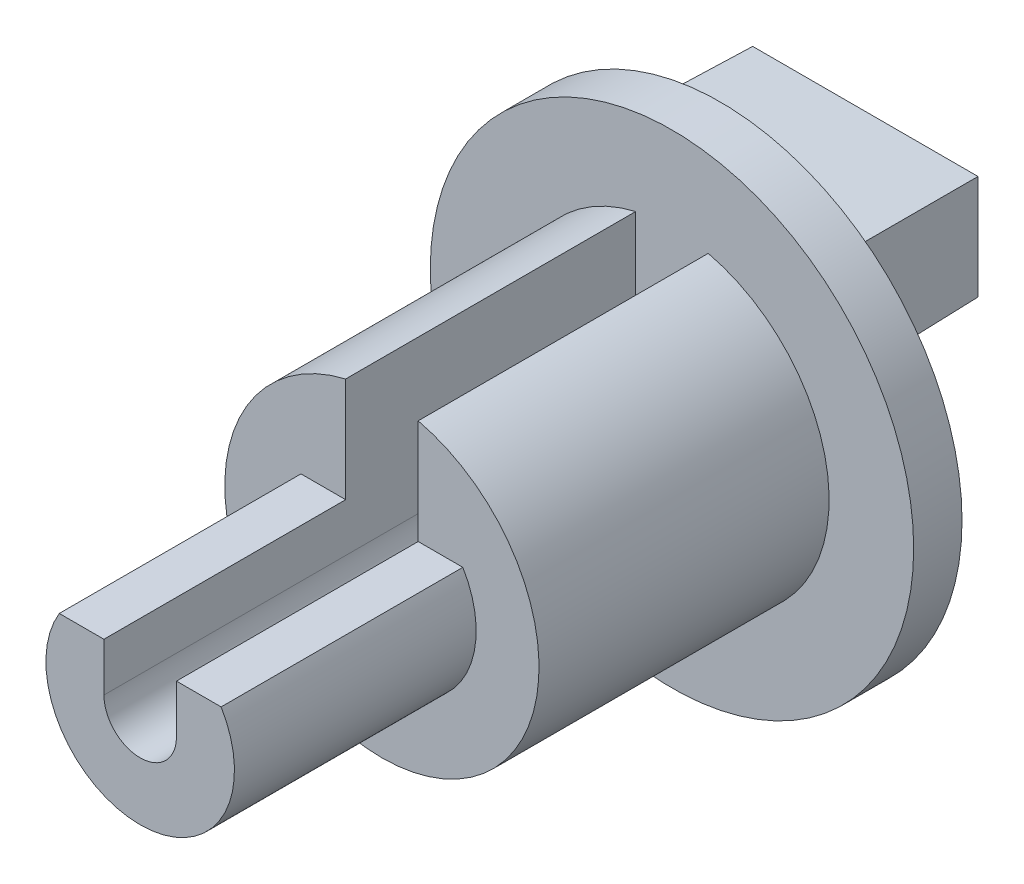
ISO-10303-21;
HEADER;
FILE_DESCRIPTION(('STEP AP214'),'2;1');
FILE_NAME('part.step','',(''),(''),'','','');
FILE_SCHEMA(('AUTOMOTIVE_DESIGN { 1 0 10303 214 1 1 1 1 }'));
ENDSEC;
DATA;
#1=APPLICATION_CONTEXT('core data for automotive mechanical design processes');
#2=APPLICATION_PROTOCOL_DEFINITION('international standard','automotive_design',2000,#1);
#3=PRODUCT_CONTEXT('',#1,'mechanical');
#4=PRODUCT('Part','Part','',(#3));
#5=PRODUCT_RELATED_PRODUCT_CATEGORY('part','',(#4));
#6=PRODUCT_DEFINITION_FORMATION('','',#4);
#7=PRODUCT_DEFINITION_CONTEXT('part definition',#1,'design');
#8=PRODUCT_DEFINITION('design','',#6,#7);
#9=PRODUCT_DEFINITION_SHAPE('','',#8);
#10=(LENGTH_UNIT() NAMED_UNIT(*) SI_UNIT(.MILLI.,.METRE.));
#11=(NAMED_UNIT(*) PLANE_ANGLE_UNIT() SI_UNIT($,.RADIAN.));
#12=(NAMED_UNIT(*) SI_UNIT($,.STERADIAN.) SOLID_ANGLE_UNIT());
#13=UNCERTAINTY_MEASURE_WITH_UNIT(LENGTH_MEASURE(1.E-05),#10,'distance_accuracy_value','');
#14=(GEOMETRIC_REPRESENTATION_CONTEXT(3) GLOBAL_UNCERTAINTY_ASSIGNED_CONTEXT((#13)) GLOBAL_UNIT_ASSIGNED_CONTEXT((#10,
#11,#12)) REPRESENTATION_CONTEXT('',''));
#15=CARTESIAN_POINT('',(0.,0.,0.));
#16=DIRECTION('',(0.,0.,1.));
#17=DIRECTION('',(1.,0.,0.));
#18=AXIS2_PLACEMENT_3D('',#15,#16,#17);
#19=CARTESIAN_POINT('',(0.,0.,6.));
#20=DIRECTION('',(0.,0.,-1.));
#21=DIRECTION('',(-1.,0.,0.));
#22=AXIS2_PLACEMENT_3D('',#19,#20,#21);
#23=CYLINDRICAL_SURFACE('',#22,3.25);
#24=CARTESIAN_POINT('',(0.,0.,6.));
#25=DIRECTION('',(0.,0.,1.));
#26=DIRECTION('',(1.,0.,0.));
#27=AXIS2_PLACEMENT_3D('',#24,#25,#26);
#28=CIRCLE('',#27,3.25);
#29=CARTESIAN_POINT('',(-0.750000000000003,3.16227766016838,6.));
#30=VERTEX_POINT('',#29);
#31=CARTESIAN_POINT('',(0.75,3.16227766016838,6.));
#32=VERTEX_POINT('',#31);
#33=EDGE_CURVE('E80',#30,#32,#28,.T.);
#34=ORIENTED_EDGE('',*,*,#33,.F.);
#35=DIRECTION('',(0.,0.,1.));
#36=VECTOR('',#35,1.);
#37=CARTESIAN_POINT('',(-0.750000000000003,3.16227766016838,-4.27200187265877));
#38=LINE('',#37,#36);
#39=CARTESIAN_POINT('',(-0.750000000000003,3.16227766016838,0.));
#40=VERTEX_POINT('',#39);
#41=EDGE_CURVE('E263',#40,#30,#38,.T.);
#42=ORIENTED_EDGE('',*,*,#41,.F.);
#43=CARTESIAN_POINT('',(0.,0.,0.));
#44=DIRECTION('',(0.,0.,1.));
#45=DIRECTION('',(1.,0.,0.));
#46=AXIS2_PLACEMENT_3D('',#43,#44,#45);
#47=CIRCLE('',#46,3.25);
#48=CARTESIAN_POINT('',(0.75,3.16227766016838,0.));
#49=VERTEX_POINT('',#48);
#50=EDGE_CURVE('E314',#40,#49,#47,.T.);
#51=ORIENTED_EDGE('',*,*,#50,.T.);
#52=DIRECTION('',(0.,0.,1.));
#53=VECTOR('',#52,1.);
#54=CARTESIAN_POINT('',(0.75,3.16227766016838,-4.27200187265877));
#55=LINE('',#54,#53);
#56=EDGE_CURVE('E270',#49,#32,#55,.T.);
#57=ORIENTED_EDGE('',*,*,#56,.T.);
#58=EDGE_LOOP('',(#34,#42,#51,#57));
#59=FACE_BOUND('',#58,.T.);
#60=ADVANCED_FACE('F73',(#59),#23,.T.);
#61=CARTESIAN_POINT('',(0.,0.,11.));
#62=DIRECTION('',(0.,0.,-1.));
#63=DIRECTION('',(-1.,0.,0.));
#64=AXIS2_PLACEMENT_3D('',#61,#62,#63);
#65=CYLINDRICAL_SURFACE('',#64,1.95);
#66=CARTESIAN_POINT('',(0.,0.,6.));
#67=DIRECTION('',(0.,0.,1.));
#68=DIRECTION('',(1.,0.,0.));
#69=AXIS2_PLACEMENT_3D('',#66,#67,#68);
#70=CIRCLE('',#69,1.95);
#71=CARTESIAN_POINT('',(-1.67406690427832,1.,6.));
#72=VERTEX_POINT('',#71);
#73=CARTESIAN_POINT('',(1.67406690427832,1.,6.));
#74=VERTEX_POINT('',#73);
#75=EDGE_CURVE('E276',#72,#74,#70,.T.);
#76=ORIENTED_EDGE('',*,*,#75,.T.);
#77=DIRECTION('',(0.,0.,-1.));
#78=VECTOR('',#77,1.);
#79=CARTESIAN_POINT('',(1.67406690427832,1.,11.));
#80=LINE('',#79,#78);
#81=CARTESIAN_POINT('',(1.67406690427832,1.,11.));
#82=VERTEX_POINT('',#81);
#83=EDGE_CURVE('E312',#82,#74,#80,.T.);
#84=ORIENTED_EDGE('',*,*,#83,.F.);
#85=CARTESIAN_POINT('',(0.,0.,11.));
#86=DIRECTION('',(0.,0.,1.));
#87=DIRECTION('',(1.,0.,0.));
#88=AXIS2_PLACEMENT_3D('',#85,#86,#87);
#89=CIRCLE('',#88,1.95);
#90=CARTESIAN_POINT('',(-1.67406690427832,1.,11.));
#91=VERTEX_POINT('',#90);
#92=EDGE_CURVE('E277',#91,#82,#89,.T.);
#93=ORIENTED_EDGE('',*,*,#92,.F.);
#94=DIRECTION('',(0.,0.,-1.));
#95=VECTOR('',#94,1.);
#96=CARTESIAN_POINT('',(-1.67406690427832,1.,11.));
#97=LINE('',#96,#95);
#98=EDGE_CURVE('E291',#91,#72,#97,.T.);
#99=ORIENTED_EDGE('',*,*,#98,.T.);
#100=EDGE_LOOP('',(#76,#84,#93,#99));
#101=FACE_BOUND('',#100,.T.);
#102=ADVANCED_FACE('F339',(#101),#65,.T.);
#103=CARTESIAN_POINT('',(-1.67406690427832,1.,11.));
#104=DIRECTION('',(0.,-1.,0.));
#105=DIRECTION('',(0.,0.,-1.));
#106=AXIS2_PLACEMENT_3D('',#103,#104,#105);
#107=PLANE('',#106);
#108=DIRECTION('',(-1.,0.,0.));
#109=VECTOR('',#108,1.);
#110=CARTESIAN_POINT('',(-1.67406690427832,1.,6.));
#111=LINE('',#110,#109);
#112=CARTESIAN_POINT('',(-0.750000000000003,1.,6.));
#113=VERTEX_POINT('',#112);
#114=EDGE_CURVE('E281',#113,#72,#111,.T.);
#115=ORIENTED_EDGE('',*,*,#114,.T.);
#116=ORIENTED_EDGE('',*,*,#98,.F.);
#117=DIRECTION('',(-1.,0.,0.));
#118=VECTOR('',#117,1.);
#119=CARTESIAN_POINT('',(-1.67406690427832,1.,11.));
#120=LINE('',#119,#118);
#121=CARTESIAN_POINT('',(-0.749999999999999,1.,11.));
#122=VERTEX_POINT('',#121);
#123=EDGE_CURVE('E289',#122,#91,#120,.T.);
#124=ORIENTED_EDGE('',*,*,#123,.F.);
#125=DIRECTION('',(0.,0.,-1.));
#126=VECTOR('',#125,1.);
#127=CARTESIAN_POINT('',(-0.749999999999999,1.,11.));
#128=LINE('',#127,#126);
#129=EDGE_CURVE('E300',#122,#113,#128,.T.);
#130=ORIENTED_EDGE('',*,*,#129,.T.);
#131=EDGE_LOOP('',(#115,#116,#124,#130));
#132=FACE_BOUND('',#131,.T.);
#133=ADVANCED_FACE('F343',(#132),#107,.F.);
#134=CARTESIAN_POINT('',(-0.750000000000003,0.,11.));
#135=DIRECTION('',(-1.,0.,0.));
#136=DIRECTION('',(0.,-1.,0.));
#137=AXIS2_PLACEMENT_3D('',#134,#135,#136);
#138=PLANE('',#137);
#139=DIRECTION('',(0.,0.,-1.));
#140=VECTOR('',#139,1.);
#141=CARTESIAN_POINT('',(-0.750000000000003,0.,11.));
#142=LINE('',#141,#140);
#143=CARTESIAN_POINT('',(-0.750000000000003,0.,11.));
#144=VERTEX_POINT('',#143);
#145=CARTESIAN_POINT('',(-0.750000000000003,0.,0.));
#146=VERTEX_POINT('',#145);
#147=EDGE_CURVE('E303',#144,#146,#142,.T.);
#148=ORIENTED_EDGE('',*,*,#147,.T.);
#149=DIRECTION('',(0.,1.,0.));
#150=VECTOR('',#149,1.);
#151=CARTESIAN_POINT('',(-0.750000000000003,0.,0.));
#152=LINE('',#151,#150);
#153=EDGE_CURVE('E259',#146,#40,#152,.T.);
#154=ORIENTED_EDGE('',*,*,#153,.T.);
#155=ORIENTED_EDGE('',*,*,#41,.T.);
#156=DIRECTION('',(0.,-1.,0.));
#157=VECTOR('',#156,1.);
#158=CARTESIAN_POINT('',(-0.750000000000003,0.,6.));
#159=LINE('',#158,#157);
#160=EDGE_CURVE('E268',#30,#113,#159,.T.);
#161=ORIENTED_EDGE('',*,*,#160,.T.);
#162=ORIENTED_EDGE('',*,*,#129,.F.);
#163=DIRECTION('',(0.,1.,0.));
#164=VECTOR('',#163,1.);
#165=CARTESIAN_POINT('',(-0.750000000000003,0.,11.));
#166=LINE('',#165,#164);
#167=EDGE_CURVE('E287',#144,#122,#166,.T.);
#168=ORIENTED_EDGE('',*,*,#167,.F.);
#169=EDGE_LOOP('',(#148,#154,#155,#161,#162,#168));
#170=FACE_BOUND('',#169,.T.);
#171=ADVANCED_FACE('F348',(#170),#138,.F.);
#172=CARTESIAN_POINT('',(0.,0.,11.));
#173=DIRECTION('',(0.,0.,1.));
#174=DIRECTION('',(1.,0.,0.));
#175=AXIS2_PLACEMENT_3D('',#172,#173,#174);
#176=PLANE('',#175);
#177=ORIENTED_EDGE('',*,*,#92,.T.);
#178=DIRECTION('',(-1.,0.,0.));
#179=VECTOR('',#178,1.);
#180=CARTESIAN_POINT('',(0.749999999999999,1.,11.));
#181=LINE('',#180,#179);
#182=CARTESIAN_POINT('',(0.749999999999999,1.,11.));
#183=VERTEX_POINT('',#182);
#184=EDGE_CURVE('E280',#82,#183,#181,.T.);
#185=ORIENTED_EDGE('',*,*,#184,.T.);
#186=DIRECTION('',(0.,-1.,0.));
#187=VECTOR('',#186,1.);
#188=CARTESIAN_POINT('',(0.750000000000003,0.,11.));
#189=LINE('',#188,#187);
#190=CARTESIAN_POINT('',(0.75,0.,11.));
#191=VERTEX_POINT('',#190);
#192=EDGE_CURVE('E283',#183,#191,#189,.T.);
#193=ORIENTED_EDGE('',*,*,#192,.T.);
#194=CARTESIAN_POINT('',(0.,0.,11.));
#195=DIRECTION('',(0.,0.,-1.));
#196=DIRECTION('',(1.,0.,0.));
#197=AXIS2_PLACEMENT_3D('',#194,#195,#196);
#198=CIRCLE('',#197,0.750000000000003);
#199=EDGE_CURVE('E285',#191,#144,#198,.T.);
#200=ORIENTED_EDGE('',*,*,#199,.T.);
#201=ORIENTED_EDGE('',*,*,#167,.T.);
#202=ORIENTED_EDGE('',*,*,#123,.T.);
#203=EDGE_LOOP('',(#177,#185,#193,#200,#201,#202));
#204=FACE_BOUND('',#203,.T.);
#205=ADVANCED_FACE('F354',(#204),#176,.T.);
#206=CARTESIAN_POINT('',(0.,0.,11.));
#207=DIRECTION('',(0.,0.,-1.));
#208=DIRECTION('',(-1.,0.,0.));
#209=AXIS2_PLACEMENT_3D('',#206,#207,#208);
#210=CYLINDRICAL_SURFACE('',#209,0.750000000000003);
#211=DIRECTION('',(0.,0.,-1.));
#212=VECTOR('',#211,1.);
#213=CARTESIAN_POINT('',(0.75,0.,11.));
#214=LINE('',#213,#212);
#215=CARTESIAN_POINT('',(0.75,0.,0.));
#216=VERTEX_POINT('',#215);
#217=EDGE_CURVE('E306',#191,#216,#214,.T.);
#218=ORIENTED_EDGE('',*,*,#217,.T.);
#219=CARTESIAN_POINT('',(0.,0.,0.));
#220=DIRECTION('',(0.,0.,1.));
#221=DIRECTION('',(1.,0.,0.));
#222=AXIS2_PLACEMENT_3D('',#219,#220,#221);
#223=CIRCLE('',#222,0.750000000000001);
#224=EDGE_CURVE('E262',#216,#146,#223,.F.);
#225=ORIENTED_EDGE('',*,*,#224,.T.);
#226=ORIENTED_EDGE('',*,*,#147,.F.);
#227=ORIENTED_EDGE('',*,*,#199,.F.);
#228=EDGE_LOOP('',(#218,#225,#226,#227));
#229=FACE_BOUND('',#228,.T.);
#230=ADVANCED_FACE('F351',(#229),#210,.F.);
#231=CARTESIAN_POINT('',(0.,0.,6.));
#232=DIRECTION('',(0.,0.,1.));
#233=DIRECTION('',(1.,0.,0.));
#234=AXIS2_PLACEMENT_3D('',#231,#232,#233);
#235=PLANE('',#234);
#236=ORIENTED_EDGE('',*,*,#160,.F.);
#237=ORIENTED_EDGE('',*,*,#33,.T.);
#238=DIRECTION('',(0.,1.,0.));
#239=VECTOR('',#238,1.);
#240=CARTESIAN_POINT('',(0.75,0.,6.));
#241=LINE('',#240,#239);
#242=CARTESIAN_POINT('',(0.75,1.,6.));
#243=VERTEX_POINT('',#242);
#244=EDGE_CURVE('E195',#243,#32,#241,.T.);
#245=ORIENTED_EDGE('',*,*,#244,.F.);
#246=DIRECTION('',(-1.,0.,0.));
#247=VECTOR('',#246,1.);
#248=CARTESIAN_POINT('',(0.749999999999999,1.,6.));
#249=LINE('',#248,#247);
#250=EDGE_CURVE('E294',#74,#243,#249,.T.);
#251=ORIENTED_EDGE('',*,*,#250,.F.);
#252=ORIENTED_EDGE('',*,*,#75,.F.);
#253=ORIENTED_EDGE('',*,*,#114,.F.);
#254=EDGE_LOOP('',(#236,#237,#245,#251,#252,#253));
#255=FACE_BOUND('',#254,.T.);
#256=ADVANCED_FACE('F332',(#255),#235,.T.);
#257=CARTESIAN_POINT('',(0.749999999999999,1.,11.));
#258=DIRECTION('',(0.,-1.,0.));
#259=DIRECTION('',(0.,0.,-1.));
#260=AXIS2_PLACEMENT_3D('',#257,#258,#259);
#261=PLANE('',#260);
#262=ORIENTED_EDGE('',*,*,#250,.T.);
#263=DIRECTION('',(0.,0.,-1.));
#264=VECTOR('',#263,1.);
#265=CARTESIAN_POINT('',(0.749999999999999,1.,11.));
#266=LINE('',#265,#264);
#267=EDGE_CURVE('E309',#183,#243,#266,.T.);
#268=ORIENTED_EDGE('',*,*,#267,.F.);
#269=ORIENTED_EDGE('',*,*,#184,.F.);
#270=ORIENTED_EDGE('',*,*,#83,.T.);
#271=EDGE_LOOP('',(#262,#268,#269,#270));
#272=FACE_BOUND('',#271,.T.);
#273=ADVANCED_FACE('F335',(#272),#261,.F.);
#274=CARTESIAN_POINT('',(0.750000000000003,0.,11.));
#275=DIRECTION('',(1.,0.,0.));
#276=DIRECTION('',(0.,1.,0.));
#277=AXIS2_PLACEMENT_3D('',#274,#275,#276);
#278=PLANE('',#277);
#279=ORIENTED_EDGE('',*,*,#267,.T.);
#280=ORIENTED_EDGE('',*,*,#244,.T.);
#281=ORIENTED_EDGE('',*,*,#56,.F.);
#282=DIRECTION('',(0.,-1.,0.));
#283=VECTOR('',#282,1.);
#284=CARTESIAN_POINT('',(0.75,0.,0.));
#285=LINE('',#284,#283);
#286=EDGE_CURVE('E266',#49,#216,#285,.T.);
#287=ORIENTED_EDGE('',*,*,#286,.T.);
#288=ORIENTED_EDGE('',*,*,#217,.F.);
#289=ORIENTED_EDGE('',*,*,#192,.F.);
#290=EDGE_LOOP('',(#279,#280,#281,#287,#288,#289));
#291=FACE_BOUND('',#290,.T.);
#292=ADVANCED_FACE('F326',(#291),#278,.F.);
#293=CARTESIAN_POINT('',(0.,0.,0.));
#294=DIRECTION('',(0.,0.,-1.));
#295=DIRECTION('',(-1.,0.,0.));
#296=AXIS2_PLACEMENT_3D('',#293,#294,#295);
#297=PLANE('',#296);
#298=ORIENTED_EDGE('',*,*,#286,.F.);
#299=ORIENTED_EDGE('',*,*,#50,.F.);
#300=ORIENTED_EDGE('',*,*,#153,.F.);
#301=ORIENTED_EDGE('',*,*,#224,.F.);
#302=EDGE_LOOP('',(#298,#299,#300,#301));
#303=FACE_BOUND('',#302,.T.);
#304=CARTESIAN_POINT('',(0.,0.,0.));
#305=DIRECTION('',(0.,0.,-1.));
#306=DIRECTION('',(-1.,0.,0.));
#307=AXIS2_PLACEMENT_3D('',#304,#305,#306);
#308=CIRCLE('',#307,5.);
#309=CARTESIAN_POINT('',(-5.,0.,0.));
#310=VERTEX_POINT('',#309);
#311=EDGE_CURVE('E217',#310,#310,#308,.T.);
#312=ORIENTED_EDGE('',*,*,#311,.F.);
#313=EDGE_LOOP('',(#312));
#314=FACE_BOUND('',#313,.T.);
#315=ADVANCED_FACE('F322',(#303,#314),#297,.F.);
#316=CARTESIAN_POINT('',(0.,0.,-1.));
#317=DIRECTION('',(0.,0.,1.));
#318=DIRECTION('',(1.,0.,0.));
#319=AXIS2_PLACEMENT_3D('',#316,#317,#318);
#320=CYLINDRICAL_SURFACE('',#319,5.);
#321=CARTESIAN_POINT('',(0.,0.,-1.));
#322=DIRECTION('',(0.,0.,-1.));
#323=DIRECTION('',(-1.,0.,0.));
#324=AXIS2_PLACEMENT_3D('',#321,#322,#323);
#325=CIRCLE('',#324,5.);
#326=CARTESIAN_POINT('',(-5.,0.,-1.));
#327=VERTEX_POINT('',#326);
#328=EDGE_CURVE('E214',#327,#327,#325,.T.);
#329=ORIENTED_EDGE('',*,*,#328,.F.);
#330=EDGE_LOOP('',(#329));
#331=FACE_BOUND('',#330,.T.);
#332=ORIENTED_EDGE('',*,*,#311,.T.);
#333=EDGE_LOOP('',(#332));
#334=FACE_BOUND('',#333,.T.);
#335=ADVANCED_FACE('F371',(#331,#334),#320,.T.);
#336=CARTESIAN_POINT('',(0.,0.,-1.));
#337=DIRECTION('',(0.,0.,-1.));
#338=DIRECTION('',(-1.,0.,0.));
#339=AXIS2_PLACEMENT_3D('',#336,#337,#338);
#340=PLANE('',#339);
#341=DIRECTION('',(0.,-1.,0.));
#342=VECTOR('',#341,1.);
#343=CARTESIAN_POINT('',(-2.38254493507178,0.,-1.));
#344=LINE('',#343,#342);
#345=CARTESIAN_POINT('',(-2.38254493507178,3.38254493507178,-1.));
#346=VERTEX_POINT('',#345);
#347=CARTESIAN_POINT('',(-2.38254493507178,1.11745506492822,-1.));
#348=VERTEX_POINT('',#347);
#349=EDGE_CURVE('E225',#346,#348,#344,.T.);
#350=ORIENTED_EDGE('',*,*,#349,.T.);
#351=DIRECTION('',(1.,0.,0.));
#352=VECTOR('',#351,1.);
#353=CARTESIAN_POINT('',(0.,1.11745506492822,-1.));
#354=LINE('',#353,#352);
#355=CARTESIAN_POINT('',(-1.13254493507178,1.11745506492822,-1.));
#356=VERTEX_POINT('',#355);
#357=EDGE_CURVE('E87',#348,#356,#354,.T.);
#358=ORIENTED_EDGE('',*,*,#357,.T.);
#359=DIRECTION('',(0.,-1.,0.));
#360=VECTOR('',#359,1.);
#361=CARTESIAN_POINT('',(-1.13254493507178,-3.4,-1.));
#362=LINE('',#361,#360);
#363=CARTESIAN_POINT('',(-1.13254493507178,-3.38254493507178,-1.));
#364=VERTEX_POINT('',#363);
#365=EDGE_CURVE('E210',#364,#356,#362,.F.);
#366=ORIENTED_EDGE('',*,*,#365,.F.);
#367=DIRECTION('',(1.,0.,0.));
#368=VECTOR('',#367,1.);
#369=CARTESIAN_POINT('',(1.15,-3.38254493507178,-1.));
#370=LINE('',#369,#368);
#371=CARTESIAN_POINT('',(1.13254493507178,-3.38254493507178,-1.));
#372=VERTEX_POINT('',#371);
#373=EDGE_CURVE('E203',#372,#364,#370,.F.);
#374=ORIENTED_EDGE('',*,*,#373,.F.);
#375=DIRECTION('',(0.,1.,0.));
#376=VECTOR('',#375,1.);
#377=CARTESIAN_POINT('',(1.13254493507178,-3.4,-1.));
#378=LINE('',#377,#376);
#379=CARTESIAN_POINT('',(1.13254493507178,1.11745506492822,-1.));
#380=VERTEX_POINT('',#379);
#381=EDGE_CURVE('E15',#372,#380,#378,.T.);
#382=ORIENTED_EDGE('',*,*,#381,.T.);
#383=DIRECTION('',(1.,0.,0.));
#384=VECTOR('',#383,1.);
#385=CARTESIAN_POINT('',(0.,1.11745506492822,-1.));
#386=LINE('',#385,#384);
#387=CARTESIAN_POINT('',(2.38254493507178,1.11745506492822,-1.));
#388=VERTEX_POINT('',#387);
#389=EDGE_CURVE('E199',#380,#388,#386,.T.);
#390=ORIENTED_EDGE('',*,*,#389,.T.);
#391=DIRECTION('',(0.,1.,0.));
#392=VECTOR('',#391,1.);
#393=CARTESIAN_POINT('',(2.38254493507178,0.,-1.));
#394=LINE('',#393,#392);
#395=CARTESIAN_POINT('',(2.38254493507178,3.38254493507178,-1.));
#396=VERTEX_POINT('',#395);
#397=EDGE_CURVE('E95',#396,#388,#394,.F.);
#398=ORIENTED_EDGE('',*,*,#397,.F.);
#399=DIRECTION('',(-1.,0.,0.));
#400=VECTOR('',#399,1.);
#401=CARTESIAN_POINT('',(0.,3.38254493507178,-1.));
#402=LINE('',#401,#400);
#403=EDGE_CURVE('E223',#346,#396,#402,.F.);
#404=ORIENTED_EDGE('',*,*,#403,.F.);
#405=EDGE_LOOP('',(#350,#358,#366,#374,#382,#390,#398,#404));
#406=FACE_BOUND('',#405,.T.);
#407=ORIENTED_EDGE('',*,*,#328,.T.);
#408=EDGE_LOOP('',(#407));
#409=FACE_BOUND('',#408,.T.);
#410=ADVANCED_FACE('F207',(#406,#409),#340,.T.);
#411=CARTESIAN_POINT('',(0.,0.,-4.));
#412=DIRECTION('',(0.,0.,-1.));
#413=DIRECTION('',(-1.,0.,0.));
#414=AXIS2_PLACEMENT_3D('',#411,#412,#413);
#415=PLANE('',#414);
#416=DIRECTION('',(1.,0.,0.));
#417=VECTOR('',#416,1.);
#418=CARTESIAN_POINT('',(0.,1.16982025971287,-4.));
#419=LINE('',#418,#417);
#420=CARTESIAN_POINT('',(1.08017974028713,1.16982025971287,-4.));
#421=VERTEX_POINT('',#420);
#422=CARTESIAN_POINT('',(2.33017974028713,1.16982025971287,-4.));
#423=VERTEX_POINT('',#422);
#424=EDGE_CURVE('E240',#421,#423,#419,.T.);
#425=ORIENTED_EDGE('',*,*,#424,.F.);
#426=DIRECTION('',(0.,1.,0.));
#427=VECTOR('',#426,1.);
#428=CARTESIAN_POINT('',(1.08017974028713,0.,-4.));
#429=LINE('',#428,#427);
#430=CARTESIAN_POINT('',(1.08017974028713,-3.33017974028713,-4.));
#431=VERTEX_POINT('',#430);
#432=EDGE_CURVE('E192',#431,#421,#429,.T.);
#433=ORIENTED_EDGE('',*,*,#432,.F.);
#434=DIRECTION('',(1.,0.,0.));
#435=VECTOR('',#434,1.);
#436=CARTESIAN_POINT('',(0.,-3.33017974028713,-4.));
#437=LINE('',#436,#435);
#438=CARTESIAN_POINT('',(-1.08017974028713,-3.33017974028713,-4.));
#439=VERTEX_POINT('',#438);
#440=EDGE_CURVE('E252',#431,#439,#437,.F.);
#441=ORIENTED_EDGE('',*,*,#440,.T.);
#442=DIRECTION('',(0.,-1.,0.));
#443=VECTOR('',#442,1.);
#444=CARTESIAN_POINT('',(-1.08017974028713,0.,-4.));
#445=LINE('',#444,#443);
#446=CARTESIAN_POINT('',(-1.08017974028713,1.16982025971287,-4.));
#447=VERTEX_POINT('',#446);
#448=EDGE_CURVE('E254',#439,#447,#445,.F.);
#449=ORIENTED_EDGE('',*,*,#448,.T.);
#450=CARTESIAN_POINT('',(-2.33017974028713,1.16982025971287,-4.));
#451=VERTEX_POINT('',#450);
#452=EDGE_CURVE('E242',#451,#447,#419,.T.);
#453=ORIENTED_EDGE('',*,*,#452,.F.);
#454=DIRECTION('',(0.,-1.,0.));
#455=VECTOR('',#454,1.);
#456=CARTESIAN_POINT('',(-2.33017974028713,0.,-4.));
#457=LINE('',#456,#455);
#458=CARTESIAN_POINT('',(-2.33017974028713,3.33017974028713,-4.));
#459=VERTEX_POINT('',#458);
#460=EDGE_CURVE('E245',#459,#451,#457,.T.);
#461=ORIENTED_EDGE('',*,*,#460,.F.);
#462=DIRECTION('',(-1.,0.,0.));
#463=VECTOR('',#462,1.);
#464=CARTESIAN_POINT('',(0.,3.33017974028713,-4.));
#465=LINE('',#464,#463);
#466=CARTESIAN_POINT('',(2.33017974028713,3.33017974028713,-4.));
#467=VERTEX_POINT('',#466);
#468=EDGE_CURVE('E233',#459,#467,#465,.F.);
#469=ORIENTED_EDGE('',*,*,#468,.T.);
#470=DIRECTION('',(0.,1.,0.));
#471=VECTOR('',#470,1.);
#472=CARTESIAN_POINT('',(2.33017974028713,0.,-4.));
#473=LINE('',#472,#471);
#474=EDGE_CURVE('E237',#467,#423,#473,.F.);
#475=ORIENTED_EDGE('',*,*,#474,.T.);
#476=EDGE_LOOP('',(#425,#433,#441,#449,#453,#461,#469,#475));
#477=FACE_BOUND('',#476,.T.);
#478=ADVANCED_FACE('F483',(#477),#415,.T.);
#479=CARTESIAN_POINT('',(-1.15,-3.4,0.));
#480=DIRECTION('',(-0.999847695156391,0.,-0.0174524064372835));
#481=DIRECTION('',(-0.0174524064372835,0.,0.999847695156391));
#482=AXIS2_PLACEMENT_3D('',#479,#480,#481);
#483=PLANE('',#482);
#484=DIRECTION('',(-0.0174497491606827,-0.0174497491606827,0.999695459881887));
#485=VECTOR('',#484,1.);
#486=CARTESIAN_POINT('',(-1.15,-3.4,0.));
#487=LINE('',#486,#485);
#488=EDGE_CURVE('E250',#439,#364,#487,.T.);
#489=ORIENTED_EDGE('',*,*,#488,.T.);
#490=ORIENTED_EDGE('',*,*,#365,.T.);
#491=DIRECTION('',(0.0174497491606827,0.0174497491606827,-0.999695459881887));
#492=VECTOR('',#491,1.);
#493=CARTESIAN_POINT('',(-1.14964983219236,1.10035016780763,-0.0200611002638141));
#494=LINE('',#493,#492);
#495=EDGE_CURVE('E196',#447,#356,#494,.F.);
#496=ORIENTED_EDGE('',*,*,#495,.F.);
#497=ORIENTED_EDGE('',*,*,#448,.F.);
#498=EDGE_LOOP('',(#489,#490,#496,#497));
#499=FACE_BOUND('',#498,.T.);
#500=ADVANCED_FACE('F488',(#499),#483,.T.);
#501=CARTESIAN_POINT('',(1.15,-3.4,0.));
#502=DIRECTION('',(0.999847695156391,0.,-0.0174524064372835));
#503=DIRECTION('',(-0.0174524064372835,0.,-0.999847695156391));
#504=AXIS2_PLACEMENT_3D('',#501,#502,#503);
#505=PLANE('',#504);
#506=ORIENTED_EDGE('',*,*,#381,.F.);
#507=DIRECTION('',(-0.0174497491606827,0.0174497491606827,-0.999695459881887));
#508=VECTOR('',#507,1.);
#509=CARTESIAN_POINT('',(1.15,-3.4,0.));
#510=LINE('',#509,#508);
#511=EDGE_CURVE('E241',#431,#372,#510,.F.);
#512=ORIENTED_EDGE('',*,*,#511,.F.);
#513=ORIENTED_EDGE('',*,*,#432,.T.);
#514=DIRECTION('',(0.0174497491606827,-0.0174497491606827,0.999695459881887));
#515=VECTOR('',#514,1.);
#516=CARTESIAN_POINT('',(1.14964983219236,1.10035016780763,-0.0200611002638141));
#517=LINE('',#516,#515);
#518=EDGE_CURVE('E187',#421,#380,#517,.T.);
#519=ORIENTED_EDGE('',*,*,#518,.T.);
#520=EDGE_LOOP('',(#506,#512,#513,#519));
#521=FACE_BOUND('',#520,.T.);
#522=ADVANCED_FACE('F189',(#521),#505,.T.);
#523=CARTESIAN_POINT('',(1.15,-3.4,0.));
#524=DIRECTION('',(0.,-0.999847695156391,-0.0174524064372835));
#525=DIRECTION('',(0.,0.0174524064372835,-0.999847695156391));
#526=AXIS2_PLACEMENT_3D('',#523,#524,#525);
#527=PLANE('',#526);
#528=ORIENTED_EDGE('',*,*,#511,.T.);
#529=ORIENTED_EDGE('',*,*,#373,.T.);
#530=ORIENTED_EDGE('',*,*,#488,.F.);
#531=ORIENTED_EDGE('',*,*,#440,.F.);
#532=EDGE_LOOP('',(#528,#529,#530,#531));
#533=FACE_BOUND('',#532,.T.);
#534=ADVANCED_FACE('F467',(#533),#527,.T.);
#535=CARTESIAN_POINT('',(0.,1.1,0.));
#536=DIRECTION('',(0.,-0.999847695156391,-0.0174524064372835));
#537=DIRECTION('',(0.,0.0174524064372835,-0.999847695156391));
#538=AXIS2_PLACEMENT_3D('',#535,#536,#537);
#539=PLANE('',#538);
#540=ORIENTED_EDGE('',*,*,#389,.F.);
#541=ORIENTED_EDGE('',*,*,#518,.F.);
#542=ORIENTED_EDGE('',*,*,#424,.T.);
#543=DIRECTION('',(-0.0174497491606827,0.0174497491606827,-0.999695459881887));
#544=VECTOR('',#543,1.);
#545=CARTESIAN_POINT('',(2.40033494312035,1.09966505687965,0.0191888785132135));
#546=LINE('',#545,#544);
#547=EDGE_CURVE('E201',#423,#388,#546,.F.);
#548=ORIENTED_EDGE('',*,*,#547,.T.);
#549=EDGE_LOOP('',(#540,#541,#542,#548));
#550=FACE_BOUND('',#549,.T.);
#551=ADVANCED_FACE('F200',(#550),#539,.T.);
#552=CARTESIAN_POINT('',(0.,3.4,0.));
#553=DIRECTION('',(0.,0.999847695156391,-0.0174524064372835));
#554=DIRECTION('',(0.,0.0174524064372835,0.999847695156391));
#555=AXIS2_PLACEMENT_3D('',#552,#553,#554);
#556=PLANE('',#555);
#557=DIRECTION('',(0.0174497491606827,-0.0174497491606827,-0.999695459881887));
#558=VECTOR('',#557,1.);
#559=CARTESIAN_POINT('',(-2.39896472126438,3.39896472126438,-0.0593110790408417));
#560=LINE('',#559,#558);
#561=EDGE_CURVE('E232',#459,#346,#560,.F.);
#562=ORIENTED_EDGE('',*,*,#561,.T.);
#563=ORIENTED_EDGE('',*,*,#403,.T.);
#564=DIRECTION('',(0.0174497491606827,0.0174497491606827,0.999695459881887));
#565=VECTOR('',#564,1.);
#566=CARTESIAN_POINT('',(2.39896472126438,3.39896472126438,-0.0593110790408417));
#567=LINE('',#566,#565);
#568=EDGE_CURVE('E230',#467,#396,#567,.T.);
#569=ORIENTED_EDGE('',*,*,#568,.F.);
#570=ORIENTED_EDGE('',*,*,#468,.F.);
#571=EDGE_LOOP('',(#562,#563,#569,#570));
#572=FACE_BOUND('',#571,.T.);
#573=ADVANCED_FACE('F458',(#572),#556,.T.);
#574=CARTESIAN_POINT('',(2.4,0.,0.));
#575=DIRECTION('',(0.999847695156391,0.,-0.0174524064372835));
#576=DIRECTION('',(-0.0174524064372835,0.,-0.999847695156391));
#577=AXIS2_PLACEMENT_3D('',#574,#575,#576);
#578=PLANE('',#577);
#579=ORIENTED_EDGE('',*,*,#568,.T.);
#580=ORIENTED_EDGE('',*,*,#397,.T.);
#581=ORIENTED_EDGE('',*,*,#547,.F.);
#582=ORIENTED_EDGE('',*,*,#474,.F.);
#583=EDGE_LOOP('',(#579,#580,#581,#582));
#584=FACE_BOUND('',#583,.T.);
#585=ADVANCED_FACE('F449',(#584),#578,.T.);
#586=CARTESIAN_POINT('',(-2.4,0.,0.));
#587=DIRECTION('',(-0.999847695156391,0.,-0.0174524064372835));
#588=DIRECTION('',(-0.0174524064372835,0.,0.999847695156391));
#589=AXIS2_PLACEMENT_3D('',#586,#587,#588);
#590=PLANE('',#589);
#591=ORIENTED_EDGE('',*,*,#349,.F.);
#592=ORIENTED_EDGE('',*,*,#561,.F.);
#593=ORIENTED_EDGE('',*,*,#460,.T.);
#594=DIRECTION('',(-0.0174497491606827,-0.0174497491606827,0.999695459881887));
#595=VECTOR('',#594,1.);
#596=CARTESIAN_POINT('',(-2.40033494312035,1.09966505687965,0.0191888785132135));
#597=LINE('',#596,#595);
#598=EDGE_CURVE('E229',#451,#348,#597,.T.);
#599=ORIENTED_EDGE('',*,*,#598,.T.);
#600=EDGE_LOOP('',(#591,#592,#593,#599));
#601=FACE_BOUND('',#600,.T.);
#602=ADVANCED_FACE('F441',(#601),#590,.T.);
#603=ORIENTED_EDGE('',*,*,#357,.F.);
#604=ORIENTED_EDGE('',*,*,#598,.F.);
#605=ORIENTED_EDGE('',*,*,#452,.T.);
#606=ORIENTED_EDGE('',*,*,#495,.T.);
#607=EDGE_LOOP('',(#603,#604,#605,#606));
#608=FACE_BOUND('',#607,.T.);
#609=ADVANCED_FACE('F435',(#608),#539,.T.);
#610=CLOSED_SHELL('',(#60,#102,#133,#171,#205,#230,#256,#273,#292,#315,#335,#410,#478,#500,#522,
#534,#551,#573,#585,#602,#609));
#611=MANIFOLD_SOLID_BREP('B2',#610);
#612=ADVANCED_BREP_SHAPE_REPRESENTATION('',(#18,#611),#14);
#613=SHAPE_DEFINITION_REPRESENTATION(#9,#612);
ENDSEC;
END-ISO-10303-21;
